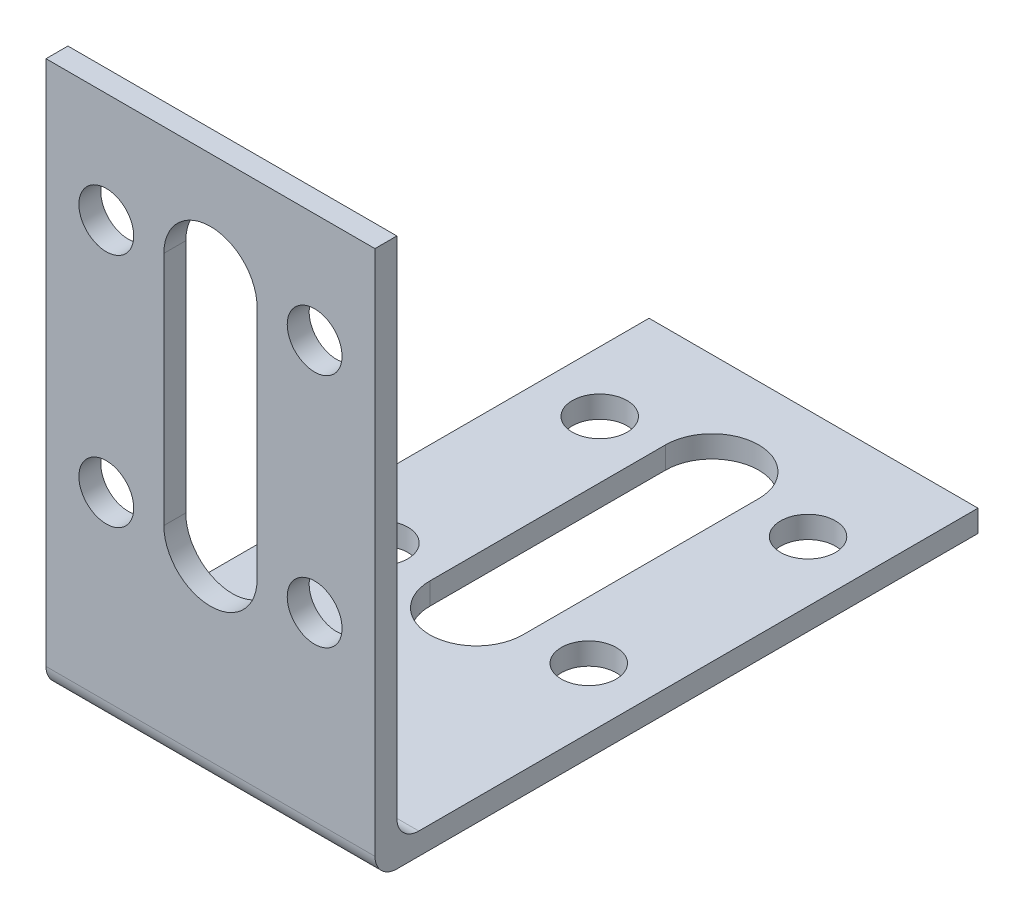
ISO-10303-21;
HEADER;
FILE_DESCRIPTION(('STEP AP214'),'2;1');
FILE_NAME('part.step','',(''),(''),'','','');
FILE_SCHEMA(('AUTOMOTIVE_DESIGN { 1 0 10303 214 1 1 1 1 }'));
ENDSEC;
DATA;
#1=APPLICATION_CONTEXT('core data for automotive mechanical design processes');
#2=APPLICATION_PROTOCOL_DEFINITION('international standard','automotive_design',2000,#1);
#3=PRODUCT_CONTEXT('',#1,'mechanical');
#4=PRODUCT('Part','Part','',(#3));
#5=PRODUCT_RELATED_PRODUCT_CATEGORY('part','',(#4));
#6=PRODUCT_DEFINITION_FORMATION('','',#4);
#7=PRODUCT_DEFINITION_CONTEXT('part definition',#1,'design');
#8=PRODUCT_DEFINITION('design','',#6,#7);
#9=PRODUCT_DEFINITION_SHAPE('','',#8);
#10=(LENGTH_UNIT() NAMED_UNIT(*) SI_UNIT(.MILLI.,.METRE.));
#11=(NAMED_UNIT(*) PLANE_ANGLE_UNIT() SI_UNIT($,.RADIAN.));
#12=(NAMED_UNIT(*) SI_UNIT($,.STERADIAN.) SOLID_ANGLE_UNIT());
#13=UNCERTAINTY_MEASURE_WITH_UNIT(LENGTH_MEASURE(1.E-05),#10,'distance_accuracy_value','');
#14=(GEOMETRIC_REPRESENTATION_CONTEXT(3) GLOBAL_UNCERTAINTY_ASSIGNED_CONTEXT((#13)) GLOBAL_UNIT_ASSIGNED_CONTEXT((#10,
#11,#12)) REPRESENTATION_CONTEXT('',''));
#15=CARTESIAN_POINT('',(0.,0.,0.));
#16=DIRECTION('',(0.,0.,1.));
#17=DIRECTION('',(1.,0.,0.));
#18=AXIS2_PLACEMENT_3D('',#15,#16,#17);
#19=CARTESIAN_POINT('',(15.,50.,-2.));
#20=DIRECTION('',(0.,0.,1.));
#21=DIRECTION('',(0.,-1.,0.));
#22=AXIS2_PLACEMENT_3D('',#19,#20,#21);
#23=PLANE('',#22);
#24=CARTESIAN_POINT('',(9.5,18.5,-2.00000000000001));
#25=DIRECTION('',(0.,0.,-1.));
#26=DIRECTION('',(0.,1.,0.));
#27=AXIS2_PLACEMENT_3D('',#24,#25,#26);
#28=CIRCLE('',#27,2.5);
#29=CARTESIAN_POINT('',(9.5,21.,-2.00000000000001));
#30=VERTEX_POINT('',#29);
#31=EDGE_CURVE('E454',#30,#30,#28,.T.);
#32=ORIENTED_EDGE('',*,*,#31,.F.);
#33=EDGE_LOOP('',(#32));
#34=FACE_BOUND('',#33,.T.);
#35=CARTESIAN_POINT('',(-9.5,40.,-2.00000000000001));
#36=DIRECTION('',(0.,0.,-1.));
#37=DIRECTION('',(0.,1.,0.));
#38=AXIS2_PLACEMENT_3D('',#35,#36,#37);
#39=CIRCLE('',#38,2.5);
#40=CARTESIAN_POINT('',(-9.5,42.5,-2.00000000000001));
#41=VERTEX_POINT('',#40);
#42=EDGE_CURVE('E442',#41,#41,#39,.T.);
#43=ORIENTED_EDGE('',*,*,#42,.F.);
#44=EDGE_LOOP('',(#43));
#45=FACE_BOUND('',#44,.T.);
#46=CARTESIAN_POINT('',(0.,18.5,-2.00000000000001));
#47=DIRECTION('',(0.,0.,-1.));
#48=DIRECTION('',(0.,1.,0.));
#49=AXIS2_PLACEMENT_3D('',#46,#47,#48);
#50=CIRCLE('',#49,4.25);
#51=CARTESIAN_POINT('',(4.25,18.5,-2.00000000000001));
#52=VERTEX_POINT('',#51);
#53=CARTESIAN_POINT('',(-4.25,18.5,-2.00000000000001));
#54=VERTEX_POINT('',#53);
#55=EDGE_CURVE('E181',#52,#54,#50,.T.);
#56=ORIENTED_EDGE('',*,*,#55,.F.);
#57=DIRECTION('',(0.,-1.,0.));
#58=VECTOR('',#57,1.);
#59=CARTESIAN_POINT('',(4.25,0.,-2.00000000000001));
#60=LINE('',#59,#58);
#61=CARTESIAN_POINT('',(4.25,40.,-2.00000000000001));
#62=VERTEX_POINT('',#61);
#63=EDGE_CURVE('E62',#62,#52,#60,.T.);
#64=ORIENTED_EDGE('',*,*,#63,.F.);
#65=CARTESIAN_POINT('',(0.,40.,-2.00000000000001));
#66=DIRECTION('',(0.,0.,-1.));
#67=DIRECTION('',(0.,1.,0.));
#68=AXIS2_PLACEMENT_3D('',#65,#66,#67);
#69=CIRCLE('',#68,4.25);
#70=CARTESIAN_POINT('',(-4.25,40.,-2.00000000000001));
#71=VERTEX_POINT('',#70);
#72=EDGE_CURVE('E167',#71,#62,#69,.T.);
#73=ORIENTED_EDGE('',*,*,#72,.F.);
#74=DIRECTION('',(0.,-1.,0.));
#75=VECTOR('',#74,1.);
#76=CARTESIAN_POINT('',(-4.25,0.,-2.00000000000001));
#77=LINE('',#76,#75);
#78=EDGE_CURVE('E187',#71,#54,#77,.T.);
#79=ORIENTED_EDGE('',*,*,#78,.T.);
#80=EDGE_LOOP('',(#56,#64,#73,#79));
#81=FACE_BOUND('',#80,.T.);
#82=DIRECTION('',(0.,1.,0.));
#83=VECTOR('',#82,1.);
#84=CARTESIAN_POINT('',(15.,50.,-2.));
#85=LINE('',#84,#83);
#86=CARTESIAN_POINT('',(15.,4.,-2.00000000000001));
#87=VERTEX_POINT('',#86);
#88=CARTESIAN_POINT('',(15.,50.,-2.));
#89=VERTEX_POINT('',#88);
#90=EDGE_CURVE('E260',#87,#89,#85,.T.);
#91=ORIENTED_EDGE('',*,*,#90,.F.);
#92=DIRECTION('',(-1.,0.,0.));
#93=VECTOR('',#92,1.);
#94=CARTESIAN_POINT('',(-15.,4.,-2.00000000000001));
#95=LINE('',#94,#93);
#96=CARTESIAN_POINT('',(-15.,4.,-2.00000000000001));
#97=VERTEX_POINT('',#96);
#98=EDGE_CURVE('E300',#87,#97,#95,.T.);
#99=ORIENTED_EDGE('',*,*,#98,.T.);
#100=DIRECTION('',(0.,1.,0.));
#101=VECTOR('',#100,1.);
#102=CARTESIAN_POINT('',(-15.,50.,-2.));
#103=LINE('',#102,#101);
#104=CARTESIAN_POINT('',(-15.,50.,-2.));
#105=VERTEX_POINT('',#104);
#106=EDGE_CURVE('E274',#97,#105,#103,.T.);
#107=ORIENTED_EDGE('',*,*,#106,.T.);
#108=DIRECTION('',(-1.,0.,0.));
#109=VECTOR('',#108,1.);
#110=CARTESIAN_POINT('',(15.,50.,-2.));
#111=LINE('',#110,#109);
#112=EDGE_CURVE('E282',#89,#105,#111,.T.);
#113=ORIENTED_EDGE('',*,*,#112,.F.);
#114=EDGE_LOOP('',(#91,#99,#107,#113));
#115=FACE_BOUND('',#114,.T.);
#116=CARTESIAN_POINT('',(9.5,40.,-2.00000000000001));
#117=DIRECTION('',(0.,0.,-1.));
#118=DIRECTION('',(0.,1.,0.));
#119=AXIS2_PLACEMENT_3D('',#116,#117,#118);
#120=CIRCLE('',#119,2.5);
#121=CARTESIAN_POINT('',(9.5,42.5,-2.00000000000001));
#122=VERTEX_POINT('',#121);
#123=EDGE_CURVE('E433',#122,#122,#120,.F.);
#124=ORIENTED_EDGE('',*,*,#123,.T.);
#125=EDGE_LOOP('',(#124));
#126=FACE_BOUND('',#125,.T.);
#127=CARTESIAN_POINT('',(-9.5,18.5,-2.00000000000001));
#128=DIRECTION('',(0.,0.,-1.));
#129=DIRECTION('',(0.,1.,0.));
#130=AXIS2_PLACEMENT_3D('',#127,#128,#129);
#131=CIRCLE('',#130,2.5);
#132=CARTESIAN_POINT('',(-9.5,21.,-2.00000000000001));
#133=VERTEX_POINT('',#132);
#134=EDGE_CURVE('E446',#133,#133,#131,.F.);
#135=ORIENTED_EDGE('',*,*,#134,.T.);
#136=EDGE_LOOP('',(#135));
#137=FACE_BOUND('',#136,.T.);
#138=ADVANCED_FACE('F47',(#34,#45,#81,#115,#126,#137),#23,.F.);
#139=CARTESIAN_POINT('',(15.,0.,0.));
#140=DIRECTION('',(0.,0.,-1.));
#141=DIRECTION('',(-1.,0.,0.));
#142=AXIS2_PLACEMENT_3D('',#139,#140,#141);
#143=PLANE('',#142);
#144=CARTESIAN_POINT('',(9.5,18.5,0.));
#145=DIRECTION('',(0.,0.,-1.));
#146=DIRECTION('',(-1.,0.,0.));
#147=AXIS2_PLACEMENT_3D('',#144,#145,#146);
#148=CIRCLE('',#147,2.5);
#149=CARTESIAN_POINT('',(7.,18.5,0.));
#150=VERTEX_POINT('',#149);
#151=EDGE_CURVE('E453',#150,#150,#148,.F.);
#152=ORIENTED_EDGE('',*,*,#151,.F.);
#153=EDGE_LOOP('',(#152));
#154=FACE_BOUND('',#153,.T.);
#155=CARTESIAN_POINT('',(-9.5,40.,0.));
#156=DIRECTION('',(0.,0.,-1.));
#157=DIRECTION('',(-1.,0.,0.));
#158=AXIS2_PLACEMENT_3D('',#155,#156,#157);
#159=CIRCLE('',#158,2.5);
#160=CARTESIAN_POINT('',(-12.,40.,0.));
#161=VERTEX_POINT('',#160);
#162=EDGE_CURVE('E438',#161,#161,#159,.F.);
#163=ORIENTED_EDGE('',*,*,#162,.F.);
#164=EDGE_LOOP('',(#163));
#165=FACE_BOUND('',#164,.T.);
#166=CARTESIAN_POINT('',(0.,40.,0.));
#167=DIRECTION('',(0.,0.,-1.));
#168=DIRECTION('',(-1.,0.,0.));
#169=AXIS2_PLACEMENT_3D('',#166,#167,#168);
#170=CIRCLE('',#169,4.25);
#171=CARTESIAN_POINT('',(4.25,40.,0.));
#172=VERTEX_POINT('',#171);
#173=CARTESIAN_POINT('',(-4.25,40.,0.));
#174=VERTEX_POINT('',#173);
#175=EDGE_CURVE('E179',#172,#174,#170,.F.);
#176=ORIENTED_EDGE('',*,*,#175,.F.);
#177=DIRECTION('',(0.,1.,0.));
#178=VECTOR('',#177,1.);
#179=CARTESIAN_POINT('',(4.25,0.,0.));
#180=LINE('',#179,#178);
#181=CARTESIAN_POINT('',(4.25,18.5,0.));
#182=VERTEX_POINT('',#181);
#183=EDGE_CURVE('E161',#182,#172,#180,.T.);
#184=ORIENTED_EDGE('',*,*,#183,.F.);
#185=CARTESIAN_POINT('',(0.,18.5,0.));
#186=DIRECTION('',(0.,0.,-1.));
#187=DIRECTION('',(-1.,0.,0.));
#188=AXIS2_PLACEMENT_3D('',#185,#186,#187);
#189=CIRCLE('',#188,4.25);
#190=CARTESIAN_POINT('',(-4.25,18.5,0.));
#191=VERTEX_POINT('',#190);
#192=EDGE_CURVE('E170',#191,#182,#189,.F.);
#193=ORIENTED_EDGE('',*,*,#192,.F.);
#194=DIRECTION('',(0.,1.,0.));
#195=VECTOR('',#194,1.);
#196=CARTESIAN_POINT('',(-4.25,0.,0.));
#197=LINE('',#196,#195);
#198=EDGE_CURVE('E70',#191,#174,#197,.T.);
#199=ORIENTED_EDGE('',*,*,#198,.T.);
#200=EDGE_LOOP('',(#176,#184,#193,#199));
#201=FACE_BOUND('',#200,.T.);
#202=DIRECTION('',(0.,-1.,0.));
#203=VECTOR('',#202,1.);
#204=CARTESIAN_POINT('',(-15.,0.,0.));
#205=LINE('',#204,#203);
#206=CARTESIAN_POINT('',(-15.,50.,0.));
#207=VERTEX_POINT('',#206);
#208=CARTESIAN_POINT('',(-15.,2.,0.));
#209=VERTEX_POINT('',#208);
#210=EDGE_CURVE('E255',#207,#209,#205,.T.);
#211=ORIENTED_EDGE('',*,*,#210,.T.);
#212=DIRECTION('',(-1.,0.,0.));
#213=VECTOR('',#212,1.);
#214=CARTESIAN_POINT('',(15.,2.,0.));
#215=LINE('',#214,#213);
#216=CARTESIAN_POINT('',(15.,2.,0.));
#217=VERTEX_POINT('',#216);
#218=EDGE_CURVE('E296',#209,#217,#215,.F.);
#219=ORIENTED_EDGE('',*,*,#218,.T.);
#220=DIRECTION('',(0.,-1.,0.));
#221=VECTOR('',#220,1.);
#222=CARTESIAN_POINT('',(15.,0.,0.));
#223=LINE('',#222,#221);
#224=CARTESIAN_POINT('',(15.,50.,0.));
#225=VERTEX_POINT('',#224);
#226=EDGE_CURVE('E264',#225,#217,#223,.T.);
#227=ORIENTED_EDGE('',*,*,#226,.F.);
#228=DIRECTION('',(-1.,0.,0.));
#229=VECTOR('',#228,1.);
#230=CARTESIAN_POINT('',(15.,50.,0.));
#231=LINE('',#230,#229);
#232=EDGE_CURVE('E267',#225,#207,#231,.T.);
#233=ORIENTED_EDGE('',*,*,#232,.T.);
#234=EDGE_LOOP('',(#211,#219,#227,#233));
#235=FACE_BOUND('',#234,.T.);
#236=CARTESIAN_POINT('',(9.5,40.,0.));
#237=DIRECTION('',(0.,0.,-1.));
#238=DIRECTION('',(-1.,0.,0.));
#239=AXIS2_PLACEMENT_3D('',#236,#237,#238);
#240=CIRCLE('',#239,2.5);
#241=CARTESIAN_POINT('',(7.,40.,0.));
#242=VERTEX_POINT('',#241);
#243=EDGE_CURVE('E436',#242,#242,#240,.T.);
#244=ORIENTED_EDGE('',*,*,#243,.T.);
#245=EDGE_LOOP('',(#244));
#246=FACE_BOUND('',#245,.T.);
#247=CARTESIAN_POINT('',(-9.5,18.5,0.));
#248=DIRECTION('',(0.,0.,-1.));
#249=DIRECTION('',(-1.,0.,0.));
#250=AXIS2_PLACEMENT_3D('',#247,#248,#249);
#251=CIRCLE('',#250,2.5);
#252=CARTESIAN_POINT('',(-12.,18.5,0.));
#253=VERTEX_POINT('',#252);
#254=EDGE_CURVE('E450',#253,#253,#251,.T.);
#255=ORIENTED_EDGE('',*,*,#254,.T.);
#256=EDGE_LOOP('',(#255));
#257=FACE_BOUND('',#256,.T.);
#258=ADVANCED_FACE('F176',(#154,#165,#201,#235,#246,#257),#143,.F.);
#259=CARTESIAN_POINT('',(15.,0.,-55.));
#260=DIRECTION('',(0.,1.,0.));
#261=DIRECTION('',(0.,0.,1.));
#262=AXIS2_PLACEMENT_3D('',#259,#260,#261);
#263=PLANE('',#262);
#264=CARTESIAN_POINT('',(9.5,0.,-45.));
#265=DIRECTION('',(0.,1.,0.));
#266=DIRECTION('',(0.,0.,1.));
#267=AXIS2_PLACEMENT_3D('',#264,#265,#266);
#268=CIRCLE('',#267,2.5);
#269=CARTESIAN_POINT('',(9.5,0.,-42.5));
#270=VERTEX_POINT('',#269);
#271=EDGE_CURVE('E209',#270,#270,#268,.F.);
#272=ORIENTED_EDGE('',*,*,#271,.F.);
#273=EDGE_LOOP('',(#272));
#274=FACE_BOUND('',#273,.T.);
#275=CARTESIAN_POINT('',(-9.49999999999999,0.,-25.));
#276=DIRECTION('',(0.,1.,0.));
#277=DIRECTION('',(0.,0.,1.));
#278=AXIS2_PLACEMENT_3D('',#275,#276,#277);
#279=CIRCLE('',#278,2.5);
#280=CARTESIAN_POINT('',(-9.49999999999999,0.,-22.5));
#281=VERTEX_POINT('',#280);
#282=EDGE_CURVE('E199',#281,#281,#279,.F.);
#283=ORIENTED_EDGE('',*,*,#282,.F.);
#284=EDGE_LOOP('',(#283));
#285=FACE_BOUND('',#284,.T.);
#286=CARTESIAN_POINT('',(0.,0.,-24.25));
#287=DIRECTION('',(0.,1.,0.));
#288=DIRECTION('',(0.,0.,1.));
#289=AXIS2_PLACEMENT_3D('',#286,#287,#288);
#290=CIRCLE('',#289,4.25);
#291=CARTESIAN_POINT('',(4.25,0.,-24.25));
#292=VERTEX_POINT('',#291);
#293=CARTESIAN_POINT('',(-4.25,0.,-24.25));
#294=VERTEX_POINT('',#293);
#295=EDGE_CURVE('E222',#292,#294,#290,.F.);
#296=ORIENTED_EDGE('',*,*,#295,.F.);
#297=DIRECTION('',(0.,0.,1.));
#298=VECTOR('',#297,1.);
#299=CARTESIAN_POINT('',(4.25,0.,0.));
#300=LINE('',#299,#298);
#301=CARTESIAN_POINT('',(4.25,0.,-45.75));
#302=VERTEX_POINT('',#301);
#303=EDGE_CURVE('E225',#302,#292,#300,.T.);
#304=ORIENTED_EDGE('',*,*,#303,.F.);
#305=CARTESIAN_POINT('',(0.,0.,-45.75));
#306=DIRECTION('',(0.,1.,0.));
#307=DIRECTION('',(0.,0.,1.));
#308=AXIS2_PLACEMENT_3D('',#305,#306,#307);
#309=CIRCLE('',#308,4.25);
#310=CARTESIAN_POINT('',(-4.25,0.,-45.75));
#311=VERTEX_POINT('',#310);
#312=EDGE_CURVE('E242',#311,#302,#309,.F.);
#313=ORIENTED_EDGE('',*,*,#312,.F.);
#314=DIRECTION('',(0.,0.,1.));
#315=VECTOR('',#314,1.);
#316=CARTESIAN_POINT('',(-4.25,0.,0.));
#317=LINE('',#316,#315);
#318=EDGE_CURVE('E203',#311,#294,#317,.T.);
#319=ORIENTED_EDGE('',*,*,#318,.T.);
#320=EDGE_LOOP('',(#296,#304,#313,#319));
#321=FACE_BOUND('',#320,.T.);
#322=DIRECTION('',(0.,0.,-1.));
#323=VECTOR('',#322,1.);
#324=CARTESIAN_POINT('',(15.,0.,-55.));
#325=LINE('',#324,#323);
#326=CARTESIAN_POINT('',(15.,0.,-2.));
#327=VERTEX_POINT('',#326);
#328=CARTESIAN_POINT('',(15.,0.,-55.));
#329=VERTEX_POINT('',#328);
#330=EDGE_CURVE('E252',#327,#329,#325,.T.);
#331=ORIENTED_EDGE('',*,*,#330,.F.);
#332=DIRECTION('',(-1.,0.,0.));
#333=VECTOR('',#332,1.);
#334=CARTESIAN_POINT('',(15.,0.,-2.));
#335=LINE('',#334,#333);
#336=CARTESIAN_POINT('',(-15.,0.,-2.));
#337=VERTEX_POINT('',#336);
#338=EDGE_CURVE('E291',#327,#337,#335,.T.);
#339=ORIENTED_EDGE('',*,*,#338,.T.);
#340=DIRECTION('',(0.,0.,-1.));
#341=VECTOR('',#340,1.);
#342=CARTESIAN_POINT('',(-15.,0.,-55.));
#343=LINE('',#342,#341);
#344=CARTESIAN_POINT('',(-15.,0.,-55.));
#345=VERTEX_POINT('',#344);
#346=EDGE_CURVE('E251',#337,#345,#343,.T.);
#347=ORIENTED_EDGE('',*,*,#346,.T.);
#348=DIRECTION('',(-1.,0.,0.));
#349=VECTOR('',#348,1.);
#350=CARTESIAN_POINT('',(15.,0.,-55.));
#351=LINE('',#350,#349);
#352=EDGE_CURVE('E288',#329,#345,#351,.T.);
#353=ORIENTED_EDGE('',*,*,#352,.F.);
#354=EDGE_LOOP('',(#331,#339,#347,#353));
#355=FACE_BOUND('',#354,.T.);
#356=CARTESIAN_POINT('',(-9.49999999999999,0.,-45.));
#357=DIRECTION('',(0.,1.,0.));
#358=DIRECTION('',(0.,0.,1.));
#359=AXIS2_PLACEMENT_3D('',#356,#357,#358);
#360=CIRCLE('',#359,2.5);
#361=CARTESIAN_POINT('',(-9.49999999999999,0.,-42.5));
#362=VERTEX_POINT('',#361);
#363=EDGE_CURVE('E206',#362,#362,#360,.T.);
#364=ORIENTED_EDGE('',*,*,#363,.T.);
#365=EDGE_LOOP('',(#364));
#366=FACE_BOUND('',#365,.T.);
#367=CARTESIAN_POINT('',(9.5,0.,-25.));
#368=DIRECTION('',(0.,1.,0.));
#369=DIRECTION('',(0.,0.,1.));
#370=AXIS2_PLACEMENT_3D('',#367,#368,#369);
#371=CIRCLE('',#370,2.5);
#372=CARTESIAN_POINT('',(9.5,0.,-22.5));
#373=VERTEX_POINT('',#372);
#374=EDGE_CURVE('E173',#373,#373,#371,.T.);
#375=ORIENTED_EDGE('',*,*,#374,.T.);
#376=EDGE_LOOP('',(#375));
#377=FACE_BOUND('',#376,.T.);
#378=ADVANCED_FACE('F338',(#274,#285,#321,#355,#366,#377),#263,.F.);
#379=CARTESIAN_POINT('',(15.,2.,-2.00000000000001));
#380=DIRECTION('',(0.,-1.,0.));
#381=DIRECTION('',(0.,0.,-1.));
#382=AXIS2_PLACEMENT_3D('',#379,#380,#381);
#383=PLANE('',#382);
#384=CARTESIAN_POINT('',(9.5,2.,-45.));
#385=DIRECTION('',(0.,1.,0.));
#386=DIRECTION('',(0.,0.,1.));
#387=AXIS2_PLACEMENT_3D('',#384,#385,#386);
#388=CIRCLE('',#387,2.5);
#389=CARTESIAN_POINT('',(9.5,2.,-42.5));
#390=VERTEX_POINT('',#389);
#391=EDGE_CURVE('E210',#390,#390,#388,.T.);
#392=ORIENTED_EDGE('',*,*,#391,.F.);
#393=EDGE_LOOP('',(#392));
#394=FACE_BOUND('',#393,.T.);
#395=CARTESIAN_POINT('',(-9.49999999999999,2.,-25.));
#396=DIRECTION('',(0.,1.,0.));
#397=DIRECTION('',(0.,0.,1.));
#398=AXIS2_PLACEMENT_3D('',#395,#396,#397);
#399=CIRCLE('',#398,2.5);
#400=CARTESIAN_POINT('',(-9.49999999999999,2.,-22.5));
#401=VERTEX_POINT('',#400);
#402=EDGE_CURVE('E196',#401,#401,#399,.T.);
#403=ORIENTED_EDGE('',*,*,#402,.F.);
#404=EDGE_LOOP('',(#403));
#405=FACE_BOUND('',#404,.T.);
#406=CARTESIAN_POINT('',(0.,2.,-45.75));
#407=DIRECTION('',(0.,1.,0.));
#408=DIRECTION('',(0.,0.,1.));
#409=AXIS2_PLACEMENT_3D('',#406,#407,#408);
#410=CIRCLE('',#409,4.25);
#411=CARTESIAN_POINT('',(4.25,2.,-45.75));
#412=VERTEX_POINT('',#411);
#413=CARTESIAN_POINT('',(-4.25,2.,-45.75));
#414=VERTEX_POINT('',#413);
#415=EDGE_CURVE('E230',#412,#414,#410,.T.);
#416=ORIENTED_EDGE('',*,*,#415,.F.);
#417=DIRECTION('',(0.,0.,-1.));
#418=VECTOR('',#417,1.);
#419=CARTESIAN_POINT('',(4.25,2.,0.));
#420=LINE('',#419,#418);
#421=CARTESIAN_POINT('',(4.25,2.,-24.25));
#422=VERTEX_POINT('',#421);
#423=EDGE_CURVE('E228',#422,#412,#420,.T.);
#424=ORIENTED_EDGE('',*,*,#423,.F.);
#425=CARTESIAN_POINT('',(0.,2.,-24.25));
#426=DIRECTION('',(0.,1.,0.));
#427=DIRECTION('',(0.,0.,1.));
#428=AXIS2_PLACEMENT_3D('',#425,#426,#427);
#429=CIRCLE('',#428,4.25);
#430=CARTESIAN_POINT('',(-4.25,2.,-24.25));
#431=VERTEX_POINT('',#430);
#432=EDGE_CURVE('E236',#431,#422,#429,.T.);
#433=ORIENTED_EDGE('',*,*,#432,.F.);
#434=DIRECTION('',(0.,0.,-1.));
#435=VECTOR('',#434,1.);
#436=CARTESIAN_POINT('',(-4.25,2.,0.));
#437=LINE('',#436,#435);
#438=EDGE_CURVE('E233',#431,#414,#437,.T.);
#439=ORIENTED_EDGE('',*,*,#438,.T.);
#440=EDGE_LOOP('',(#416,#424,#433,#439));
#441=FACE_BOUND('',#440,.T.);
#442=DIRECTION('',(0.,0.,1.));
#443=VECTOR('',#442,1.);
#444=CARTESIAN_POINT('',(-15.,2.,-2.00000000000001));
#445=LINE('',#444,#443);
#446=CARTESIAN_POINT('',(-15.,2.,-55.));
#447=VERTEX_POINT('',#446);
#448=CARTESIAN_POINT('',(-15.,2.,-4.00000000000001));
#449=VERTEX_POINT('',#448);
#450=EDGE_CURVE('E271',#447,#449,#445,.T.);
#451=ORIENTED_EDGE('',*,*,#450,.T.);
#452=DIRECTION('',(-1.,0.,0.));
#453=VECTOR('',#452,1.);
#454=CARTESIAN_POINT('',(15.,2.,-4.00000000000001));
#455=LINE('',#454,#453);
#456=CARTESIAN_POINT('',(15.,2.,-4.00000000000001));
#457=VERTEX_POINT('',#456);
#458=EDGE_CURVE('E303',#449,#457,#455,.F.);
#459=ORIENTED_EDGE('',*,*,#458,.T.);
#460=DIRECTION('',(0.,0.,1.));
#461=VECTOR('',#460,1.);
#462=CARTESIAN_POINT('',(15.,2.,-2.00000000000001));
#463=LINE('',#462,#461);
#464=CARTESIAN_POINT('',(15.,2.,-55.));
#465=VERTEX_POINT('',#464);
#466=EDGE_CURVE('E257',#465,#457,#463,.T.);
#467=ORIENTED_EDGE('',*,*,#466,.F.);
#468=DIRECTION('',(-1.,0.,0.));
#469=VECTOR('',#468,1.);
#470=CARTESIAN_POINT('',(15.,2.,-55.));
#471=LINE('',#470,#469);
#472=EDGE_CURVE('E285',#465,#447,#471,.T.);
#473=ORIENTED_EDGE('',*,*,#472,.T.);
#474=EDGE_LOOP('',(#451,#459,#467,#473));
#475=FACE_BOUND('',#474,.T.);
#476=CARTESIAN_POINT('',(-9.49999999999999,2.,-45.));
#477=DIRECTION('',(0.,1.,0.));
#478=DIRECTION('',(0.,0.,1.));
#479=AXIS2_PLACEMENT_3D('',#476,#477,#478);
#480=CIRCLE('',#479,2.5);
#481=CARTESIAN_POINT('',(-9.49999999999999,2.,-42.5));
#482=VERTEX_POINT('',#481);
#483=EDGE_CURVE('E200',#482,#482,#480,.F.);
#484=ORIENTED_EDGE('',*,*,#483,.T.);
#485=EDGE_LOOP('',(#484));
#486=FACE_BOUND('',#485,.T.);
#487=CARTESIAN_POINT('',(9.5,2.,-25.));
#488=DIRECTION('',(0.,1.,0.));
#489=DIRECTION('',(0.,0.,1.));
#490=AXIS2_PLACEMENT_3D('',#487,#488,#489);
#491=CIRCLE('',#490,2.5);
#492=CARTESIAN_POINT('',(9.5,2.,-22.5));
#493=VERTEX_POINT('',#492);
#494=EDGE_CURVE('E213',#493,#493,#491,.F.);
#495=ORIENTED_EDGE('',*,*,#494,.T.);
#496=EDGE_LOOP('',(#495));
#497=FACE_BOUND('',#496,.T.);
#498=ADVANCED_FACE('F315',(#394,#405,#441,#475,#486,#497),#383,.F.);
#499=CARTESIAN_POINT('',(15.,2.,-55.));
#500=DIRECTION('',(0.,0.,1.));
#501=DIRECTION('',(1.,0.,0.));
#502=AXIS2_PLACEMENT_3D('',#499,#500,#501);
#503=PLANE('',#502);
#504=DIRECTION('',(0.,1.,0.));
#505=VECTOR('',#504,1.);
#506=CARTESIAN_POINT('',(-15.,2.,-55.));
#507=LINE('',#506,#505);
#508=EDGE_CURVE('E269',#345,#447,#507,.T.);
#509=ORIENTED_EDGE('',*,*,#508,.T.);
#510=ORIENTED_EDGE('',*,*,#472,.F.);
#511=DIRECTION('',(0.,1.,0.));
#512=VECTOR('',#511,1.);
#513=CARTESIAN_POINT('',(15.,2.,-55.));
#514=LINE('',#513,#512);
#515=EDGE_CURVE('E254',#329,#465,#514,.T.);
#516=ORIENTED_EDGE('',*,*,#515,.F.);
#517=ORIENTED_EDGE('',*,*,#352,.T.);
#518=EDGE_LOOP('',(#509,#510,#516,#517));
#519=FACE_BOUND('',#518,.T.);
#520=ADVANCED_FACE('F344',(#519),#503,.F.);
#521=CARTESIAN_POINT('',(15.,50.,0.));
#522=DIRECTION('',(0.,-1.,0.));
#523=DIRECTION('',(0.,0.,-1.));
#524=AXIS2_PLACEMENT_3D('',#521,#522,#523);
#525=PLANE('',#524);
#526=DIRECTION('',(0.,0.,1.));
#527=VECTOR('',#526,1.);
#528=CARTESIAN_POINT('',(-15.,50.,0.));
#529=LINE('',#528,#527);
#530=EDGE_CURVE('E276',#105,#207,#529,.T.);
#531=ORIENTED_EDGE('',*,*,#530,.T.);
#532=ORIENTED_EDGE('',*,*,#232,.F.);
#533=DIRECTION('',(0.,0.,1.));
#534=VECTOR('',#533,1.);
#535=CARTESIAN_POINT('',(15.,50.,0.));
#536=LINE('',#535,#534);
#537=EDGE_CURVE('E262',#89,#225,#536,.T.);
#538=ORIENTED_EDGE('',*,*,#537,.F.);
#539=ORIENTED_EDGE('',*,*,#112,.T.);
#540=EDGE_LOOP('',(#531,#532,#538,#539));
#541=FACE_BOUND('',#540,.T.);
#542=ADVANCED_FACE('F329',(#541),#525,.F.);
#543=CARTESIAN_POINT('',(15.,0.,0.));
#544=DIRECTION('',(-1.,0.,0.));
#545=DIRECTION('',(0.,0.,1.));
#546=AXIS2_PLACEMENT_3D('',#543,#544,#545);
#547=PLANE('',#546);
#548=ORIENTED_EDGE('',*,*,#226,.T.);
#549=CARTESIAN_POINT('',(15.,2.,-2.));
#550=DIRECTION('',(-1.,0.,0.));
#551=DIRECTION('',(0.,0.,1.));
#552=AXIS2_PLACEMENT_3D('',#549,#550,#551);
#553=CIRCLE('',#552,2.);
#554=EDGE_CURVE('E298',#217,#327,#553,.F.);
#555=ORIENTED_EDGE('',*,*,#554,.T.);
#556=ORIENTED_EDGE('',*,*,#330,.T.);
#557=ORIENTED_EDGE('',*,*,#515,.T.);
#558=ORIENTED_EDGE('',*,*,#466,.T.);
#559=CARTESIAN_POINT('',(15.,4.,-4.00000000000001));
#560=DIRECTION('',(-1.,0.,0.));
#561=DIRECTION('',(0.,0.,1.));
#562=AXIS2_PLACEMENT_3D('',#559,#560,#561);
#563=CIRCLE('',#562,2.);
#564=EDGE_CURVE('E13',#457,#87,#563,.T.);
#565=ORIENTED_EDGE('',*,*,#564,.T.);
#566=ORIENTED_EDGE('',*,*,#90,.T.);
#567=ORIENTED_EDGE('',*,*,#537,.T.);
#568=EDGE_LOOP('',(#548,#555,#556,#557,#558,#565,#566,#567));
#569=FACE_BOUND('',#568,.T.);
#570=ADVANCED_FACE('F322',(#569),#547,.F.);
#571=CARTESIAN_POINT('',(-15.,0.,0.));
#572=DIRECTION('',(-1.,0.,0.));
#573=DIRECTION('',(0.,0.,1.));
#574=AXIS2_PLACEMENT_3D('',#571,#572,#573);
#575=PLANE('',#574);
#576=ORIENTED_EDGE('',*,*,#346,.F.);
#577=CARTESIAN_POINT('',(-15.,2.,-2.));
#578=DIRECTION('',(-1.,0.,0.));
#579=DIRECTION('',(0.,0.,1.));
#580=AXIS2_PLACEMENT_3D('',#577,#578,#579);
#581=CIRCLE('',#580,2.);
#582=EDGE_CURVE('E294',#337,#209,#581,.T.);
#583=ORIENTED_EDGE('',*,*,#582,.T.);
#584=ORIENTED_EDGE('',*,*,#210,.F.);
#585=ORIENTED_EDGE('',*,*,#530,.F.);
#586=ORIENTED_EDGE('',*,*,#106,.F.);
#587=CARTESIAN_POINT('',(-15.,4.,-4.00000000000001));
#588=DIRECTION('',(-1.,0.,0.));
#589=DIRECTION('',(0.,0.,1.));
#590=AXIS2_PLACEMENT_3D('',#587,#588,#589);
#591=CIRCLE('',#590,2.);
#592=EDGE_CURVE('E55',#97,#449,#591,.F.);
#593=ORIENTED_EDGE('',*,*,#592,.T.);
#594=ORIENTED_EDGE('',*,*,#450,.F.);
#595=ORIENTED_EDGE('',*,*,#508,.F.);
#596=EDGE_LOOP('',(#576,#583,#584,#585,#586,#593,#594,#595));
#597=FACE_BOUND('',#596,.T.);
#598=ADVANCED_FACE('F308',(#597),#575,.T.);
#599=CARTESIAN_POINT('',(15.,2.,-2.));
#600=DIRECTION('',(-1.,0.,0.));
#601=DIRECTION('',(0.,0.,1.));
#602=AXIS2_PLACEMENT_3D('',#599,#600,#601);
#603=CYLINDRICAL_SURFACE('',#602,2.);
#604=ORIENTED_EDGE('',*,*,#554,.F.);
#605=ORIENTED_EDGE('',*,*,#218,.F.);
#606=ORIENTED_EDGE('',*,*,#582,.F.);
#607=ORIENTED_EDGE('',*,*,#338,.F.);
#608=EDGE_LOOP('',(#604,#605,#606,#607));
#609=FACE_BOUND('',#608,.T.);
#610=ADVANCED_FACE('F336',(#609),#603,.T.);
#611=CARTESIAN_POINT('',(15.,4.,-4.00000000000001));
#612=DIRECTION('',(1.,0.,0.));
#613=DIRECTION('',(0.,0.,-1.));
#614=AXIS2_PLACEMENT_3D('',#611,#612,#613);
#615=CYLINDRICAL_SURFACE('',#614,2.);
#616=ORIENTED_EDGE('',*,*,#564,.F.);
#617=ORIENTED_EDGE('',*,*,#458,.F.);
#618=ORIENTED_EDGE('',*,*,#592,.F.);
#619=ORIENTED_EDGE('',*,*,#98,.F.);
#620=EDGE_LOOP('',(#616,#617,#618,#619));
#621=FACE_BOUND('',#620,.T.);
#622=ADVANCED_FACE('F49',(#621),#615,.F.);
#623=CARTESIAN_POINT('',(4.25,-0.00100000000000317,0.));
#624=DIRECTION('',(1.,0.,0.));
#625=DIRECTION('',(0.,0.,-1.));
#626=AXIS2_PLACEMENT_3D('',#623,#624,#625);
#627=PLANE('',#626);
#628=ORIENTED_EDGE('',*,*,#303,.T.);
#629=DIRECTION('',(0.,1.,0.));
#630=VECTOR('',#629,1.);
#631=CARTESIAN_POINT('',(4.25,-0.00100000000000187,-24.25));
#632=LINE('',#631,#630);
#633=EDGE_CURVE('E240',#292,#422,#632,.T.);
#634=ORIENTED_EDGE('',*,*,#633,.T.);
#635=ORIENTED_EDGE('',*,*,#423,.T.);
#636=DIRECTION('',(0.,1.,0.));
#637=VECTOR('',#636,1.);
#638=CARTESIAN_POINT('',(4.25,-0.00100000000000057,-45.75));
#639=LINE('',#638,#637);
#640=EDGE_CURVE('E239',#302,#412,#639,.T.);
#641=ORIENTED_EDGE('',*,*,#640,.F.);
#642=EDGE_LOOP('',(#628,#634,#635,#641));
#643=FACE_BOUND('',#642,.T.);
#644=ADVANCED_FACE('F370',(#643),#627,.F.);
#645=CARTESIAN_POINT('',(0.,-0.00100000000000187,-24.25));
#646=DIRECTION('',(0.,1.,0.));
#647=DIRECTION('',(0.,0.,1.));
#648=AXIS2_PLACEMENT_3D('',#645,#646,#647);
#649=CYLINDRICAL_SURFACE('',#648,4.25);
#650=ORIENTED_EDGE('',*,*,#295,.T.);
#651=DIRECTION('',(0.,1.,0.));
#652=VECTOR('',#651,1.);
#653=CARTESIAN_POINT('',(-4.25,-0.00100000000000187,-24.25));
#654=LINE('',#653,#652);
#655=EDGE_CURVE('E243',#294,#431,#654,.T.);
#656=ORIENTED_EDGE('',*,*,#655,.T.);
#657=ORIENTED_EDGE('',*,*,#432,.T.);
#658=ORIENTED_EDGE('',*,*,#633,.F.);
#659=EDGE_LOOP('',(#650,#656,#657,#658));
#660=FACE_BOUND('',#659,.T.);
#661=ADVANCED_FACE('F373',(#660),#649,.F.);
#662=CARTESIAN_POINT('',(-4.25,-0.00100000000000317,0.));
#663=DIRECTION('',(1.,0.,0.));
#664=DIRECTION('',(0.,0.,-1.));
#665=AXIS2_PLACEMENT_3D('',#662,#663,#664);
#666=PLANE('',#665);
#667=DIRECTION('',(0.,1.,0.));
#668=VECTOR('',#667,1.);
#669=CARTESIAN_POINT('',(-4.25,-0.00100000000000057,-45.75));
#670=LINE('',#669,#668);
#671=EDGE_CURVE('E245',#311,#414,#670,.T.);
#672=ORIENTED_EDGE('',*,*,#671,.T.);
#673=ORIENTED_EDGE('',*,*,#438,.F.);
#674=ORIENTED_EDGE('',*,*,#655,.F.);
#675=ORIENTED_EDGE('',*,*,#318,.F.);
#676=EDGE_LOOP('',(#672,#673,#674,#675));
#677=FACE_BOUND('',#676,.T.);
#678=ADVANCED_FACE('F379',(#677),#666,.T.);
#679=CARTESIAN_POINT('',(0.,-0.00100000000000057,-45.75));
#680=DIRECTION('',(0.,1.,0.));
#681=DIRECTION('',(0.,0.,1.));
#682=AXIS2_PLACEMENT_3D('',#679,#680,#681);
#683=CYLINDRICAL_SURFACE('',#682,4.25);
#684=ORIENTED_EDGE('',*,*,#312,.T.);
#685=ORIENTED_EDGE('',*,*,#640,.T.);
#686=ORIENTED_EDGE('',*,*,#415,.T.);
#687=ORIENTED_EDGE('',*,*,#671,.F.);
#688=EDGE_LOOP('',(#684,#685,#686,#687));
#689=FACE_BOUND('',#688,.T.);
#690=ADVANCED_FACE('F375',(#689),#683,.F.);
#691=CARTESIAN_POINT('',(-9.49999999999999,-0.00100000000000187,-25.));
#692=DIRECTION('',(0.,1.,0.));
#693=DIRECTION('',(0.,0.,1.));
#694=AXIS2_PLACEMENT_3D('',#691,#692,#693);
#695=CYLINDRICAL_SURFACE('',#694,2.5);
#696=ORIENTED_EDGE('',*,*,#402,.T.);
#697=EDGE_LOOP('',(#696));
#698=FACE_BOUND('',#697,.T.);
#699=ORIENTED_EDGE('',*,*,#282,.T.);
#700=EDGE_LOOP('',(#699));
#701=FACE_BOUND('',#700,.T.);
#702=ADVANCED_FACE('F378',(#698,#701),#695,.F.);
#703=CARTESIAN_POINT('',(-9.49999999999999,-0.00100000000000057,-45.));
#704=DIRECTION('',(0.,1.,0.));
#705=DIRECTION('',(0.,0.,1.));
#706=AXIS2_PLACEMENT_3D('',#703,#704,#705);
#707=CYLINDRICAL_SURFACE('',#706,2.5);
#708=ORIENTED_EDGE('',*,*,#483,.F.);
#709=EDGE_LOOP('',(#708));
#710=FACE_BOUND('',#709,.T.);
#711=ORIENTED_EDGE('',*,*,#363,.F.);
#712=EDGE_LOOP('',(#711));
#713=FACE_BOUND('',#712,.T.);
#714=ADVANCED_FACE('F394',(#710,#713),#707,.F.);
#715=CARTESIAN_POINT('',(9.5,-0.00100000000000057,-45.));
#716=DIRECTION('',(0.,1.,0.));
#717=DIRECTION('',(0.,0.,1.));
#718=AXIS2_PLACEMENT_3D('',#715,#716,#717);
#719=CYLINDRICAL_SURFACE('',#718,2.5);
#720=ORIENTED_EDGE('',*,*,#391,.T.);
#721=EDGE_LOOP('',(#720));
#722=FACE_BOUND('',#721,.T.);
#723=ORIENTED_EDGE('',*,*,#271,.T.);
#724=EDGE_LOOP('',(#723));
#725=FACE_BOUND('',#724,.T.);
#726=ADVANCED_FACE('F390',(#722,#725),#719,.F.);
#727=CARTESIAN_POINT('',(9.5,-0.00100000000000187,-25.));
#728=DIRECTION('',(0.,1.,0.));
#729=DIRECTION('',(0.,0.,1.));
#730=AXIS2_PLACEMENT_3D('',#727,#728,#729);
#731=CYLINDRICAL_SURFACE('',#730,2.5);
#732=ORIENTED_EDGE('',*,*,#494,.F.);
#733=EDGE_LOOP('',(#732));
#734=FACE_BOUND('',#733,.T.);
#735=ORIENTED_EDGE('',*,*,#374,.F.);
#736=EDGE_LOOP('',(#735));
#737=FACE_BOUND('',#736,.T.);
#738=ADVANCED_FACE('F387',(#734,#737),#731,.F.);
#739=CARTESIAN_POINT('',(4.25,0.,0.00100000000000013));
#740=DIRECTION('',(1.,0.,0.));
#741=DIRECTION('',(0.,0.,-1.));
#742=AXIS2_PLACEMENT_3D('',#739,#740,#741);
#743=PLANE('',#742);
#744=ORIENTED_EDGE('',*,*,#183,.T.);
#745=DIRECTION('',(0.,0.,-1.));
#746=VECTOR('',#745,1.);
#747=CARTESIAN_POINT('',(4.25,40.,0.0010000000000062));
#748=LINE('',#747,#746);
#749=EDGE_CURVE('E174',#172,#62,#748,.T.);
#750=ORIENTED_EDGE('',*,*,#749,.T.);
#751=ORIENTED_EDGE('',*,*,#63,.T.);
#752=DIRECTION('',(0.,0.,-1.));
#753=VECTOR('',#752,1.);
#754=CARTESIAN_POINT('',(4.25,18.5,0.00100000000000273));
#755=LINE('',#754,#753);
#756=EDGE_CURVE('E157',#182,#52,#755,.T.);
#757=ORIENTED_EDGE('',*,*,#756,.F.);
#758=EDGE_LOOP('',(#744,#750,#751,#757));
#759=FACE_BOUND('',#758,.T.);
#760=ADVANCED_FACE('F159',(#759),#743,.F.);
#761=CARTESIAN_POINT('',(0.,40.,0.0010000000000062));
#762=DIRECTION('',(0.,0.,-1.));
#763=DIRECTION('',(0.,1.,0.));
#764=AXIS2_PLACEMENT_3D('',#761,#762,#763);
#765=CYLINDRICAL_SURFACE('',#764,4.25);
#766=ORIENTED_EDGE('',*,*,#175,.T.);
#767=DIRECTION('',(0.,0.,-1.));
#768=VECTOR('',#767,1.);
#769=CARTESIAN_POINT('',(-4.25,40.,0.0010000000000062));
#770=LINE('',#769,#768);
#771=EDGE_CURVE('E193',#174,#71,#770,.T.);
#772=ORIENTED_EDGE('',*,*,#771,.T.);
#773=ORIENTED_EDGE('',*,*,#72,.T.);
#774=ORIENTED_EDGE('',*,*,#749,.F.);
#775=EDGE_LOOP('',(#766,#772,#773,#774));
#776=FACE_BOUND('',#775,.T.);
#777=ADVANCED_FACE('F404',(#776),#765,.F.);
#778=CARTESIAN_POINT('',(-4.25,0.,0.00100000000000013));
#779=DIRECTION('',(1.,0.,0.));
#780=DIRECTION('',(0.,0.,-1.));
#781=AXIS2_PLACEMENT_3D('',#778,#779,#780);
#782=PLANE('',#781);
#783=DIRECTION('',(0.,0.,-1.));
#784=VECTOR('',#783,1.);
#785=CARTESIAN_POINT('',(-4.25,18.5,0.00100000000000273));
#786=LINE('',#785,#784);
#787=EDGE_CURVE('E166',#191,#54,#786,.T.);
#788=ORIENTED_EDGE('',*,*,#787,.T.);
#789=ORIENTED_EDGE('',*,*,#78,.F.);
#790=ORIENTED_EDGE('',*,*,#771,.F.);
#791=ORIENTED_EDGE('',*,*,#198,.F.);
#792=EDGE_LOOP('',(#788,#789,#790,#791));
#793=FACE_BOUND('',#792,.T.);
#794=ADVANCED_FACE('F408',(#793),#782,.T.);
#795=CARTESIAN_POINT('',(0.,18.5,0.00100000000000273));
#796=DIRECTION('',(0.,0.,-1.));
#797=DIRECTION('',(0.,1.,0.));
#798=AXIS2_PLACEMENT_3D('',#795,#796,#797);
#799=CYLINDRICAL_SURFACE('',#798,4.25);
#800=ORIENTED_EDGE('',*,*,#192,.T.);
#801=ORIENTED_EDGE('',*,*,#756,.T.);
#802=ORIENTED_EDGE('',*,*,#55,.T.);
#803=ORIENTED_EDGE('',*,*,#787,.F.);
#804=EDGE_LOOP('',(#800,#801,#802,#803));
#805=FACE_BOUND('',#804,.T.);
#806=ADVANCED_FACE('F171',(#805),#799,.F.);
#807=CARTESIAN_POINT('',(9.5,40.,0.0010000000000062));
#808=DIRECTION('',(0.,0.,-1.));
#809=DIRECTION('',(0.,1.,0.));
#810=AXIS2_PLACEMENT_3D('',#807,#808,#809);
#811=CYLINDRICAL_SURFACE('',#810,2.5);
#812=ORIENTED_EDGE('',*,*,#123,.F.);
#813=EDGE_LOOP('',(#812));
#814=FACE_BOUND('',#813,.T.);
#815=ORIENTED_EDGE('',*,*,#243,.F.);
#816=EDGE_LOOP('',(#815));
#817=FACE_BOUND('',#816,.T.);
#818=ADVANCED_FACE('F407',(#814,#817),#811,.F.);
#819=CARTESIAN_POINT('',(-9.5,40.,0.0010000000000062));
#820=DIRECTION('',(0.,0.,-1.));
#821=DIRECTION('',(0.,1.,0.));
#822=AXIS2_PLACEMENT_3D('',#819,#820,#821);
#823=CYLINDRICAL_SURFACE('',#822,2.5);
#824=ORIENTED_EDGE('',*,*,#42,.T.);
#825=EDGE_LOOP('',(#824));
#826=FACE_BOUND('',#825,.T.);
#827=ORIENTED_EDGE('',*,*,#162,.T.);
#828=EDGE_LOOP('',(#827));
#829=FACE_BOUND('',#828,.T.);
#830=ADVANCED_FACE('F421',(#826,#829),#823,.F.);
#831=CARTESIAN_POINT('',(-9.5,18.5,0.00100000000000273));
#832=DIRECTION('',(0.,0.,-1.));
#833=DIRECTION('',(0.,1.,0.));
#834=AXIS2_PLACEMENT_3D('',#831,#832,#833);
#835=CYLINDRICAL_SURFACE('',#834,2.5);
#836=ORIENTED_EDGE('',*,*,#134,.F.);
#837=EDGE_LOOP('',(#836));
#838=FACE_BOUND('',#837,.T.);
#839=ORIENTED_EDGE('',*,*,#254,.F.);
#840=EDGE_LOOP('',(#839));
#841=FACE_BOUND('',#840,.T.);
#842=ADVANCED_FACE('F417',(#838,#841),#835,.F.);
#843=CARTESIAN_POINT('',(9.5,18.5,0.00100000000000273));
#844=DIRECTION('',(0.,0.,-1.));
#845=DIRECTION('',(0.,1.,0.));
#846=AXIS2_PLACEMENT_3D('',#843,#844,#845);
#847=CYLINDRICAL_SURFACE('',#846,2.5);
#848=ORIENTED_EDGE('',*,*,#31,.T.);
#849=EDGE_LOOP('',(#848));
#850=FACE_BOUND('',#849,.T.);
#851=ORIENTED_EDGE('',*,*,#151,.T.);
#852=EDGE_LOOP('',(#851));
#853=FACE_BOUND('',#852,.T.);
#854=ADVANCED_FACE('F414',(#850,#853),#847,.F.);
#855=CLOSED_SHELL('',(#138,#258,#378,#498,#520,#542,#570,#598,#610,#622,#644,#661,#678,#690,
#702,#714,#726,#738,#760,#777,#794,#806,#818,#830,#842,#854));
#856=MANIFOLD_SOLID_BREP('B2',#855);
#857=ADVANCED_BREP_SHAPE_REPRESENTATION('',(#18,#856),#14);
#858=SHAPE_DEFINITION_REPRESENTATION(#9,#857);
ENDSEC;
END-ISO-10303-21;
